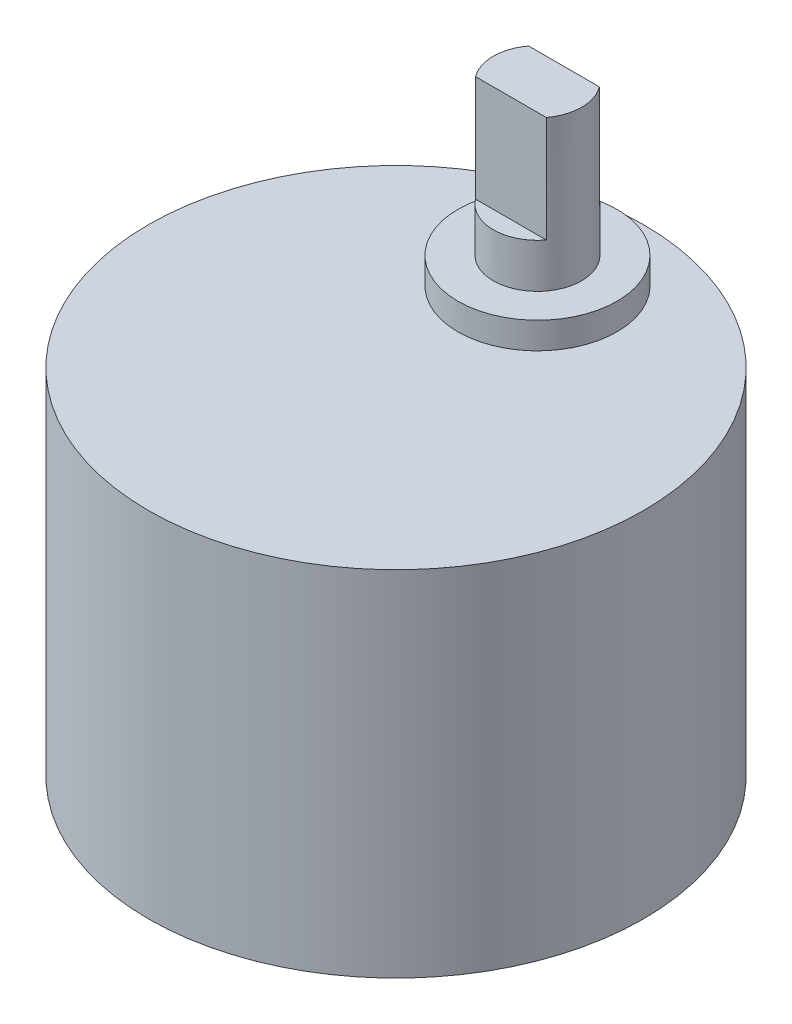
ISO-10303-21;
HEADER;
FILE_DESCRIPTION(('STEP AP214'),'2;1');
FILE_NAME('part.step','',(''),(''),'','','');
FILE_SCHEMA(('AUTOMOTIVE_DESIGN { 1 0 10303 214 1 1 1 1 }'));
ENDSEC;
DATA;
#1=APPLICATION_CONTEXT('core data for automotive mechanical design processes');
#2=APPLICATION_PROTOCOL_DEFINITION('international standard','automotive_design',2000,#1);
#3=PRODUCT_CONTEXT('',#1,'mechanical');
#4=PRODUCT('Part','Part','',(#3));
#5=PRODUCT_RELATED_PRODUCT_CATEGORY('part','',(#4));
#6=PRODUCT_DEFINITION_FORMATION('','',#4);
#7=PRODUCT_DEFINITION_CONTEXT('part definition',#1,'design');
#8=PRODUCT_DEFINITION('design','',#6,#7);
#9=PRODUCT_DEFINITION_SHAPE('','',#8);
#10=(LENGTH_UNIT() NAMED_UNIT(*) SI_UNIT(.MILLI.,.METRE.));
#11=(NAMED_UNIT(*) PLANE_ANGLE_UNIT() SI_UNIT($,.RADIAN.));
#12=(NAMED_UNIT(*) SI_UNIT($,.STERADIAN.) SOLID_ANGLE_UNIT());
#13=UNCERTAINTY_MEASURE_WITH_UNIT(LENGTH_MEASURE(1.E-05),#10,'distance_accuracy_value','');
#14=(GEOMETRIC_REPRESENTATION_CONTEXT(3) GLOBAL_UNCERTAINTY_ASSIGNED_CONTEXT((#13)) GLOBAL_UNIT_ASSIGNED_CONTEXT((#10,
#11,#12)) REPRESENTATION_CONTEXT('',''));
#15=CARTESIAN_POINT('',(0.,0.,0.));
#16=DIRECTION('',(0.,0.,1.));
#17=DIRECTION('',(1.,0.,0.));
#18=AXIS2_PLACEMENT_3D('',#15,#16,#17);
#19=CARTESIAN_POINT('',(0.,20.,0.));
#20=DIRECTION('',(0.,-1.,0.));
#21=DIRECTION('',(0.,0.,-1.));
#22=AXIS2_PLACEMENT_3D('',#19,#20,#21);
#23=CYLINDRICAL_SURFACE('',#22,14.);
#24=CARTESIAN_POINT('',(0.,20.,0.));
#25=DIRECTION('',(0.,1.,0.));
#26=DIRECTION('',(0.,0.,1.));
#27=AXIS2_PLACEMENT_3D('',#24,#25,#26);
#28=CIRCLE('',#27,14.);
#29=CARTESIAN_POINT('',(0.,20.,14.));
#30=VERTEX_POINT('',#29);
#31=EDGE_CURVE('E40',#30,#30,#28,.T.);
#32=ORIENTED_EDGE('',*,*,#31,.F.);
#33=EDGE_LOOP('',(#32));
#34=FACE_BOUND('',#33,.T.);
#35=CARTESIAN_POINT('',(0.,0.,0.));
#36=DIRECTION('',(0.,1.,0.));
#37=DIRECTION('',(0.,0.,1.));
#38=AXIS2_PLACEMENT_3D('',#35,#36,#37);
#39=CIRCLE('',#38,14.);
#40=CARTESIAN_POINT('',(0.,0.,14.));
#41=VERTEX_POINT('',#40);
#42=EDGE_CURVE('E35',#41,#41,#39,.T.);
#43=ORIENTED_EDGE('',*,*,#42,.T.);
#44=EDGE_LOOP('',(#43));
#45=FACE_BOUND('',#44,.T.);
#46=ADVANCED_FACE('F32',(#34,#45),#23,.T.);
#47=CARTESIAN_POINT('',(0.,20.,0.));
#48=DIRECTION('',(0.,1.,0.));
#49=DIRECTION('',(0.,0.,1.));
#50=AXIS2_PLACEMENT_3D('',#47,#48,#49);
#51=PLANE('',#50);
#52=CARTESIAN_POINT('',(0.,20.,-8.));
#53=DIRECTION('',(0.,1.,0.));
#54=DIRECTION('',(0.,0.,1.));
#55=AXIS2_PLACEMENT_3D('',#52,#53,#54);
#56=CIRCLE('',#55,4.5);
#57=CARTESIAN_POINT('',(0.,20.,-3.5));
#58=VERTEX_POINT('',#57);
#59=EDGE_CURVE('E107',#58,#58,#56,.T.);
#60=ORIENTED_EDGE('',*,*,#59,.F.);
#61=EDGE_LOOP('',(#60));
#62=FACE_BOUND('',#61,.T.);
#63=ORIENTED_EDGE('',*,*,#31,.T.);
#64=EDGE_LOOP('',(#63));
#65=FACE_BOUND('',#64,.T.);
#66=ADVANCED_FACE('F123',(#62,#65),#51,.T.);
#67=CARTESIAN_POINT('',(0.,0.,0.));
#68=DIRECTION('',(0.,1.,0.));
#69=DIRECTION('',(0.,0.,1.));
#70=AXIS2_PLACEMENT_3D('',#67,#68,#69);
#71=PLANE('',#70);
#72=ORIENTED_EDGE('',*,*,#42,.F.);
#73=EDGE_LOOP('',(#72));
#74=FACE_BOUND('',#73,.T.);
#75=ADVANCED_FACE('F120',(#74),#71,.F.);
#76=CARTESIAN_POINT('',(0.,21.5,-8.));
#77=DIRECTION('',(0.,-1.,0.));
#78=DIRECTION('',(0.,0.,-1.));
#79=AXIS2_PLACEMENT_3D('',#76,#77,#78);
#80=CYLINDRICAL_SURFACE('',#79,4.5);
#81=CARTESIAN_POINT('',(0.,21.5,-8.));
#82=DIRECTION('',(0.,1.,0.));
#83=DIRECTION('',(0.,0.,1.));
#84=AXIS2_PLACEMENT_3D('',#81,#82,#83);
#85=CIRCLE('',#84,4.5);
#86=CARTESIAN_POINT('',(0.,21.5,-3.5));
#87=VERTEX_POINT('',#86);
#88=EDGE_CURVE('E109',#87,#87,#85,.T.);
#89=ORIENTED_EDGE('',*,*,#88,.F.);
#90=EDGE_LOOP('',(#89));
#91=FACE_BOUND('',#90,.T.);
#92=ORIENTED_EDGE('',*,*,#59,.T.);
#93=EDGE_LOOP('',(#92));
#94=FACE_BOUND('',#93,.T.);
#95=ADVANCED_FACE('F122',(#91,#94),#80,.T.);
#96=CARTESIAN_POINT('',(0.,21.5,-8.));
#97=DIRECTION('',(0.,1.,0.));
#98=DIRECTION('',(0.,0.,1.));
#99=AXIS2_PLACEMENT_3D('',#96,#97,#98);
#100=PLANE('',#99);
#101=CARTESIAN_POINT('',(0.,21.5,-8.));
#102=DIRECTION('',(0.,1.,0.));
#103=DIRECTION('',(0.,0.,1.));
#104=AXIS2_PLACEMENT_3D('',#101,#102,#103);
#105=CIRCLE('',#104,2.5);
#106=CARTESIAN_POINT('',(0.,21.5,-5.5));
#107=VERTEX_POINT('',#106);
#108=EDGE_CURVE('E11',#107,#107,#105,.T.);
#109=ORIENTED_EDGE('',*,*,#108,.F.);
#110=EDGE_LOOP('',(#109));
#111=FACE_BOUND('',#110,.T.);
#112=ORIENTED_EDGE('',*,*,#88,.T.);
#113=EDGE_LOOP('',(#112));
#114=FACE_BOUND('',#113,.T.);
#115=ADVANCED_FACE('F128',(#111,#114),#100,.T.);
#116=CARTESIAN_POINT('',(0.,30.,-8.));
#117=DIRECTION('',(0.,-1.,0.));
#118=DIRECTION('',(0.,0.,-1.));
#119=AXIS2_PLACEMENT_3D('',#116,#117,#118);
#120=CYLINDRICAL_SURFACE('',#119,2.5);
#121=CARTESIAN_POINT('',(0.,30.,-8.));
#122=DIRECTION('',(0.,1.,0.));
#123=DIRECTION('',(0.,0.,1.));
#124=AXIS2_PLACEMENT_3D('',#121,#122,#123);
#125=CIRCLE('',#124,2.5);
#126=CARTESIAN_POINT('',(2.,30.,-6.5));
#127=VERTEX_POINT('',#126);
#128=CARTESIAN_POINT('',(2.,30.,-9.5));
#129=VERTEX_POINT('',#128);
#130=EDGE_CURVE('E91',#127,#129,#125,.T.);
#131=ORIENTED_EDGE('',*,*,#130,.F.);
#132=DIRECTION('',(0.,1.,0.));
#133=VECTOR('',#132,1.);
#134=CARTESIAN_POINT('',(2.,24.,-6.5));
#135=LINE('',#134,#133);
#136=CARTESIAN_POINT('',(2.,24.,-6.5));
#137=VERTEX_POINT('',#136);
#138=EDGE_CURVE('E56',#137,#127,#135,.T.);
#139=ORIENTED_EDGE('',*,*,#138,.F.);
#140=CARTESIAN_POINT('',(0.,24.,-8.));
#141=DIRECTION('',(0.,1.,0.));
#142=DIRECTION('',(0.,0.,-1.));
#143=AXIS2_PLACEMENT_3D('',#140,#141,#142);
#144=CIRCLE('',#143,2.5);
#145=CARTESIAN_POINT('',(-2.,24.,-6.5));
#146=VERTEX_POINT('',#145);
#147=EDGE_CURVE('E76',#146,#137,#144,.T.);
#148=ORIENTED_EDGE('',*,*,#147,.F.);
#149=DIRECTION('',(0.,1.,0.));
#150=VECTOR('',#149,1.);
#151=CARTESIAN_POINT('',(-2.,24.,-6.5));
#152=LINE('',#151,#150);
#153=CARTESIAN_POINT('',(-2.,30.,-6.5));
#154=VERTEX_POINT('',#153);
#155=EDGE_CURVE('E84',#146,#154,#152,.T.);
#156=ORIENTED_EDGE('',*,*,#155,.T.);
#157=CARTESIAN_POINT('',(-2.,30.,-9.5));
#158=VERTEX_POINT('',#157);
#159=EDGE_CURVE('E93',#158,#154,#125,.T.);
#160=ORIENTED_EDGE('',*,*,#159,.F.);
#161=DIRECTION('',(0.,1.,0.));
#162=VECTOR('',#161,1.);
#163=CARTESIAN_POINT('',(-2.,24.,-9.5));
#164=LINE('',#163,#162);
#165=CARTESIAN_POINT('',(-2.,24.,-9.5));
#166=VERTEX_POINT('',#165);
#167=EDGE_CURVE('E48',#166,#158,#164,.T.);
#168=ORIENTED_EDGE('',*,*,#167,.F.);
#169=CARTESIAN_POINT('',(0.,24.,-8.));
#170=DIRECTION('',(0.,1.,0.));
#171=DIRECTION('',(0.,0.,1.));
#172=AXIS2_PLACEMENT_3D('',#169,#170,#171);
#173=CIRCLE('',#172,2.5);
#174=CARTESIAN_POINT('',(2.,24.,-9.5));
#175=VERTEX_POINT('',#174);
#176=EDGE_CURVE('E97',#175,#166,#173,.T.);
#177=ORIENTED_EDGE('',*,*,#176,.F.);
#178=DIRECTION('',(0.,1.,0.));
#179=VECTOR('',#178,1.);
#180=CARTESIAN_POINT('',(2.,24.,-9.5));
#181=LINE('',#180,#179);
#182=EDGE_CURVE('E104',#175,#129,#181,.T.);
#183=ORIENTED_EDGE('',*,*,#182,.T.);
#184=EDGE_LOOP('',(#131,#139,#148,#156,#160,#168,#177,#183));
#185=FACE_BOUND('',#184,.T.);
#186=ORIENTED_EDGE('',*,*,#108,.T.);
#187=EDGE_LOOP('',(#186));
#188=FACE_BOUND('',#187,.T.);
#189=ADVANCED_FACE('F87',(#185,#188),#120,.T.);
#190=CARTESIAN_POINT('',(0.,30.,-8.));
#191=DIRECTION('',(0.,1.,0.));
#192=DIRECTION('',(0.,0.,1.));
#193=AXIS2_PLACEMENT_3D('',#190,#191,#192);
#194=PLANE('',#193);
#195=DIRECTION('',(-1.,0.,0.));
#196=VECTOR('',#195,1.);
#197=CARTESIAN_POINT('',(-2.,30.,-6.5));
#198=LINE('',#197,#196);
#199=EDGE_CURVE('E81',#127,#154,#198,.T.);
#200=ORIENTED_EDGE('',*,*,#199,.F.);
#201=ORIENTED_EDGE('',*,*,#130,.T.);
#202=DIRECTION('',(1.,0.,0.));
#203=VECTOR('',#202,1.);
#204=CARTESIAN_POINT('',(2.,30.,-9.5));
#205=LINE('',#204,#203);
#206=EDGE_CURVE('E100',#158,#129,#205,.T.);
#207=ORIENTED_EDGE('',*,*,#206,.F.);
#208=ORIENTED_EDGE('',*,*,#159,.T.);
#209=EDGE_LOOP('',(#200,#201,#207,#208));
#210=FACE_BOUND('',#209,.T.);
#211=ADVANCED_FACE('F167',(#210),#194,.T.);
#212=CARTESIAN_POINT('',(2.,24.,-9.5));
#213=DIRECTION('',(0.,0.,1.));
#214=DIRECTION('',(1.,0.,0.));
#215=AXIS2_PLACEMENT_3D('',#212,#213,#214);
#216=PLANE('',#215);
#217=ORIENTED_EDGE('',*,*,#206,.T.);
#218=ORIENTED_EDGE('',*,*,#182,.F.);
#219=DIRECTION('',(1.,0.,0.));
#220=VECTOR('',#219,1.);
#221=CARTESIAN_POINT('',(2.,24.,-9.5));
#222=LINE('',#221,#220);
#223=EDGE_CURVE('E99',#166,#175,#222,.T.);
#224=ORIENTED_EDGE('',*,*,#223,.F.);
#225=ORIENTED_EDGE('',*,*,#167,.T.);
#226=EDGE_LOOP('',(#217,#218,#224,#225));
#227=FACE_BOUND('',#226,.T.);
#228=ADVANCED_FACE('F176',(#227),#216,.F.);
#229=CARTESIAN_POINT('',(0.,24.,-8.));
#230=DIRECTION('',(0.,1.,0.));
#231=DIRECTION('',(0.,0.,1.));
#232=AXIS2_PLACEMENT_3D('',#229,#230,#231);
#233=PLANE('',#232);
#234=ORIENTED_EDGE('',*,*,#176,.T.);
#235=ORIENTED_EDGE('',*,*,#223,.T.);
#236=EDGE_LOOP('',(#234,#235));
#237=FACE_BOUND('',#236,.T.);
#238=ADVANCED_FACE('F186',(#237),#233,.T.);
#239=CARTESIAN_POINT('',(-2.,24.,-6.5));
#240=DIRECTION('',(0.,0.,-1.));
#241=DIRECTION('',(-1.,0.,0.));
#242=AXIS2_PLACEMENT_3D('',#239,#240,#241);
#243=PLANE('',#242);
#244=ORIENTED_EDGE('',*,*,#199,.T.);
#245=ORIENTED_EDGE('',*,*,#155,.F.);
#246=DIRECTION('',(-1.,0.,0.));
#247=VECTOR('',#246,1.);
#248=CARTESIAN_POINT('',(-2.,24.,-6.5));
#249=LINE('',#248,#247);
#250=EDGE_CURVE('E78',#137,#146,#249,.T.);
#251=ORIENTED_EDGE('',*,*,#250,.F.);
#252=ORIENTED_EDGE('',*,*,#138,.T.);
#253=EDGE_LOOP('',(#244,#245,#251,#252));
#254=FACE_BOUND('',#253,.T.);
#255=ADVANCED_FACE('F83',(#254),#243,.F.);
#256=CARTESIAN_POINT('',(0.,24.,-8.));
#257=DIRECTION('',(0.,-1.,0.));
#258=DIRECTION('',(0.,0.,-1.));
#259=AXIS2_PLACEMENT_3D('',#256,#257,#258);
#260=PLANE('',#259);
#261=ORIENTED_EDGE('',*,*,#147,.T.);
#262=ORIENTED_EDGE('',*,*,#250,.T.);
#263=EDGE_LOOP('',(#261,#262));
#264=FACE_BOUND('',#263,.T.);
#265=ADVANCED_FACE('F77',(#264),#260,.F.);
#266=CLOSED_SHELL('',(#46,#66,#75,#95,#115,#189,#211,#228,#238,#255,#265));
#267=MANIFOLD_SOLID_BREP('B2',#266);
#268=ADVANCED_BREP_SHAPE_REPRESENTATION('',(#18,#267),#14);
#269=SHAPE_DEFINITION_REPRESENTATION(#9,#268);
ENDSEC;
END-ISO-10303-21;
